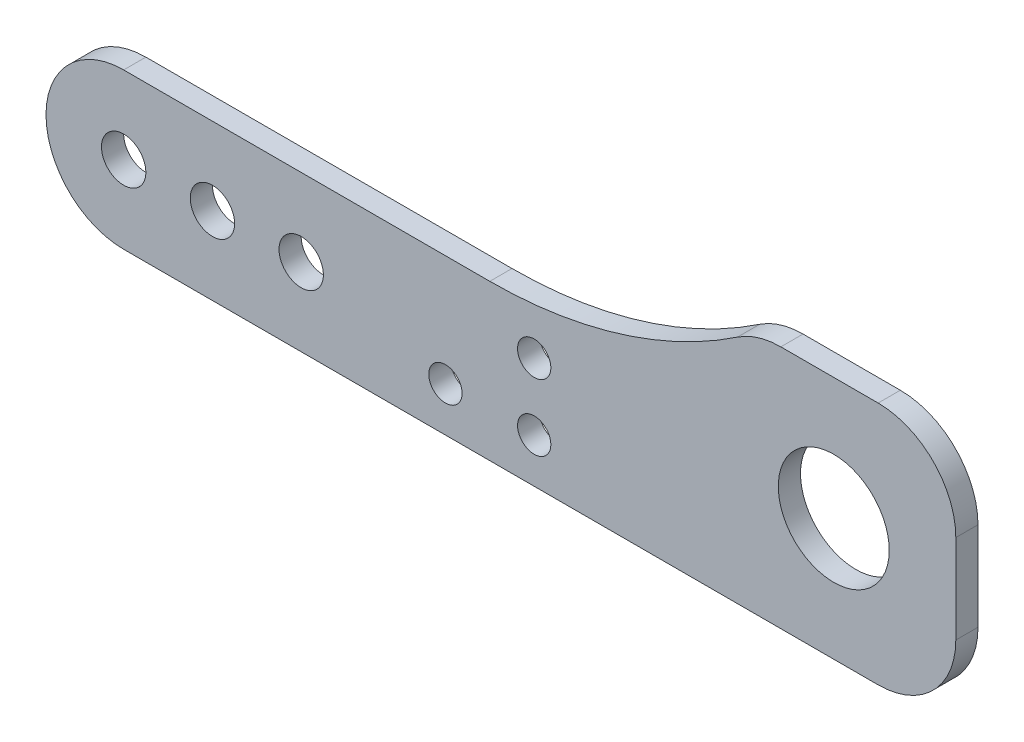
ISO-10303-21;
HEADER;
FILE_DESCRIPTION(('STEP AP214'),'2;1');
FILE_NAME('part.step','',(''),(''),'','','');
FILE_SCHEMA(('AUTOMOTIVE_DESIGN { 1 0 10303 214 1 1 1 1 }'));
ENDSEC;
DATA;
#1=APPLICATION_CONTEXT('core data for automotive mechanical design processes');
#2=APPLICATION_PROTOCOL_DEFINITION('international standard','automotive_design',2000,#1);
#3=PRODUCT_CONTEXT('',#1,'mechanical');
#4=PRODUCT('Part','Part','',(#3));
#5=PRODUCT_RELATED_PRODUCT_CATEGORY('part','',(#4));
#6=PRODUCT_DEFINITION_FORMATION('','',#4);
#7=PRODUCT_DEFINITION_CONTEXT('part definition',#1,'design');
#8=PRODUCT_DEFINITION('design','',#6,#7);
#9=PRODUCT_DEFINITION_SHAPE('','',#8);
#10=(LENGTH_UNIT() NAMED_UNIT(*) SI_UNIT(.MILLI.,.METRE.));
#11=(NAMED_UNIT(*) PLANE_ANGLE_UNIT() SI_UNIT($,.RADIAN.));
#12=(NAMED_UNIT(*) SI_UNIT($,.STERADIAN.) SOLID_ANGLE_UNIT());
#13=UNCERTAINTY_MEASURE_WITH_UNIT(LENGTH_MEASURE(1.E-05),#10,'distance_accuracy_value','');
#14=(GEOMETRIC_REPRESENTATION_CONTEXT(3) GLOBAL_UNCERTAINTY_ASSIGNED_CONTEXT((#13)) GLOBAL_UNIT_ASSIGNED_CONTEXT((#10,
#11,#12)) REPRESENTATION_CONTEXT('',''));
#15=CARTESIAN_POINT('',(0.,0.,0.));
#16=DIRECTION('',(0.,0.,1.));
#17=DIRECTION('',(1.,0.,0.));
#18=AXIS2_PLACEMENT_3D('',#15,#16,#17);
#19=CARTESIAN_POINT('',(68.,0.,2.));
#20=DIRECTION('',(0.,0.,-1.));
#21=DIRECTION('',(-1.,0.,0.));
#22=AXIS2_PLACEMENT_3D('',#19,#20,#21);
#23=CYLINDRICAL_SURFACE('',#22,7.);
#24=CARTESIAN_POINT('',(68.,0.,0.));
#25=DIRECTION('',(0.,0.,1.));
#26=DIRECTION('',(1.,0.,0.));
#27=AXIS2_PLACEMENT_3D('',#24,#25,#26);
#28=CIRCLE('',#27,7.);
#29=CARTESIAN_POINT('',(68.,-6.99999999999999,0.));
#30=VERTEX_POINT('',#29);
#31=CARTESIAN_POINT('',(75.,0.,0.));
#32=VERTEX_POINT('',#31);
#33=EDGE_CURVE('E146',#30,#32,#28,.T.);
#34=ORIENTED_EDGE('',*,*,#33,.T.);
#35=DIRECTION('',(0.,0.,-1.));
#36=VECTOR('',#35,1.);
#37=CARTESIAN_POINT('',(75.,0.,2.));
#38=LINE('',#37,#36);
#39=CARTESIAN_POINT('',(75.,0.,2.));
#40=VERTEX_POINT('',#39);
#41=EDGE_CURVE('E11',#40,#32,#38,.T.);
#42=ORIENTED_EDGE('',*,*,#41,.F.);
#43=CARTESIAN_POINT('',(68.,0.,2.));
#44=DIRECTION('',(0.,0.,1.));
#45=DIRECTION('',(1.,0.,0.));
#46=AXIS2_PLACEMENT_3D('',#43,#44,#45);
#47=CIRCLE('',#46,7.);
#48=CARTESIAN_POINT('',(68.,-6.99999999999999,2.));
#49=VERTEX_POINT('',#48);
#50=EDGE_CURVE('E172',#49,#40,#47,.T.);
#51=ORIENTED_EDGE('',*,*,#50,.F.);
#52=DIRECTION('',(0.,0.,-1.));
#53=VECTOR('',#52,1.);
#54=CARTESIAN_POINT('',(68.,-6.99999999999999,2.));
#55=LINE('',#54,#53);
#56=EDGE_CURVE('E142',#49,#30,#55,.T.);
#57=ORIENTED_EDGE('',*,*,#56,.T.);
#58=EDGE_LOOP('',(#34,#42,#51,#57));
#59=FACE_BOUND('',#58,.T.);
#60=ADVANCED_FACE('F39',(#59),#23,.T.);
#61=CARTESIAN_POINT('',(75.,0.,2.));
#62=DIRECTION('',(-1.,0.,0.));
#63=DIRECTION('',(0.,-1.,0.));
#64=AXIS2_PLACEMENT_3D('',#61,#62,#63);
#65=PLANE('',#64);
#66=DIRECTION('',(0.,1.,0.));
#67=VECTOR('',#66,1.);
#68=CARTESIAN_POINT('',(75.,0.,0.));
#69=LINE('',#68,#67);
#70=CARTESIAN_POINT('',(75.,8.00000000000001,0.));
#71=VERTEX_POINT('',#70);
#72=EDGE_CURVE('E150',#32,#71,#69,.T.);
#73=ORIENTED_EDGE('',*,*,#72,.T.);
#74=DIRECTION('',(0.,0.,-1.));
#75=VECTOR('',#74,1.);
#76=CARTESIAN_POINT('',(75.,8.00000000000001,2.));
#77=LINE('',#76,#75);
#78=CARTESIAN_POINT('',(75.,8.00000000000001,2.));
#79=VERTEX_POINT('',#78);
#80=EDGE_CURVE('E48',#79,#71,#77,.T.);
#81=ORIENTED_EDGE('',*,*,#80,.F.);
#82=DIRECTION('',(0.,1.,0.));
#83=VECTOR('',#82,1.);
#84=CARTESIAN_POINT('',(75.,0.,2.));
#85=LINE('',#84,#83);
#86=EDGE_CURVE('E102',#40,#79,#85,.T.);
#87=ORIENTED_EDGE('',*,*,#86,.F.);
#88=ORIENTED_EDGE('',*,*,#41,.T.);
#89=EDGE_LOOP('',(#73,#81,#87,#88));
#90=FACE_BOUND('',#89,.T.);
#91=ADVANCED_FACE('F315',(#90),#65,.F.);
#92=CARTESIAN_POINT('',(68.,8.00000000000001,2.));
#93=DIRECTION('',(0.,0.,-1.));
#94=DIRECTION('',(-1.,0.,0.));
#95=AXIS2_PLACEMENT_3D('',#92,#93,#94);
#96=CYLINDRICAL_SURFACE('',#95,7.);
#97=CARTESIAN_POINT('',(68.,8.00000000000001,0.));
#98=DIRECTION('',(0.,0.,1.));
#99=DIRECTION('',(-1.,0.,0.));
#100=AXIS2_PLACEMENT_3D('',#97,#98,#99);
#101=CIRCLE('',#100,7.);
#102=CARTESIAN_POINT('',(68.,15.,0.));
#103=VERTEX_POINT('',#102);
#104=EDGE_CURVE('E154',#71,#103,#101,.T.);
#105=ORIENTED_EDGE('',*,*,#104,.T.);
#106=DIRECTION('',(0.,0.,-1.));
#107=VECTOR('',#106,1.);
#108=CARTESIAN_POINT('',(68.,15.,2.));
#109=LINE('',#108,#107);
#110=CARTESIAN_POINT('',(68.,15.,2.));
#111=VERTEX_POINT('',#110);
#112=EDGE_CURVE('E187',#111,#103,#109,.T.);
#113=ORIENTED_EDGE('',*,*,#112,.F.);
#114=CARTESIAN_POINT('',(68.,8.00000000000001,2.));
#115=DIRECTION('',(0.,0.,1.));
#116=DIRECTION('',(-1.,0.,0.));
#117=AXIS2_PLACEMENT_3D('',#114,#115,#116);
#118=CIRCLE('',#117,7.);
#119=EDGE_CURVE('E197',#79,#111,#118,.T.);
#120=ORIENTED_EDGE('',*,*,#119,.F.);
#121=ORIENTED_EDGE('',*,*,#80,.T.);
#122=EDGE_LOOP('',(#105,#113,#120,#121));
#123=FACE_BOUND('',#122,.T.);
#124=ADVANCED_FACE('F195',(#123),#96,.T.);
#125=CARTESIAN_POINT('',(59.229754097208,15.,2.));
#126=DIRECTION('',(0.,-1.,0.));
#127=DIRECTION('',(0.,0.,-1.));
#128=AXIS2_PLACEMENT_3D('',#125,#126,#127);
#129=PLANE('',#128);
#130=DIRECTION('',(-1.,0.,0.));
#131=VECTOR('',#130,1.);
#132=CARTESIAN_POINT('',(59.229754097208,15.,0.));
#133=LINE('',#132,#131);
#134=CARTESIAN_POINT('',(59.229754097208,15.,0.));
#135=VERTEX_POINT('',#134);
#136=EDGE_CURVE('E157',#103,#135,#133,.T.);
#137=ORIENTED_EDGE('',*,*,#136,.T.);
#138=DIRECTION('',(0.,0.,-1.));
#139=VECTOR('',#138,1.);
#140=CARTESIAN_POINT('',(59.229754097208,15.,2.));
#141=LINE('',#140,#139);
#142=CARTESIAN_POINT('',(59.229754097208,15.,2.));
#143=VERTEX_POINT('',#142);
#144=EDGE_CURVE('E183',#143,#135,#141,.T.);
#145=ORIENTED_EDGE('',*,*,#144,.F.);
#146=DIRECTION('',(-1.,0.,0.));
#147=VECTOR('',#146,1.);
#148=CARTESIAN_POINT('',(59.229754097208,15.,2.));
#149=LINE('',#148,#147);
#150=EDGE_CURVE('E214',#111,#143,#149,.T.);
#151=ORIENTED_EDGE('',*,*,#150,.F.);
#152=ORIENTED_EDGE('',*,*,#112,.T.);
#153=EDGE_LOOP('',(#137,#145,#151,#152));
#154=FACE_BOUND('',#153,.T.);
#155=ADVANCED_FACE('F206',(#154),#129,.F.);
#156=CARTESIAN_POINT('',(59.229754097208,8.00000000000001,2.));
#157=DIRECTION('',(0.,0.,-1.));
#158=DIRECTION('',(-1.,0.,0.));
#159=AXIS2_PLACEMENT_3D('',#156,#157,#158);
#160=CYLINDRICAL_SURFACE('',#159,7.);
#161=CARTESIAN_POINT('',(59.229754097208,8.00000000000001,0.));
#162=DIRECTION('',(0.,0.,1.));
#163=DIRECTION('',(1.,0.,0.));
#164=AXIS2_PLACEMENT_3D('',#161,#162,#163);
#165=CIRCLE('',#164,7.);
#166=CARTESIAN_POINT('',(55.3231949763472,13.8085106382979,0.));
#167=VERTEX_POINT('',#166);
#168=EDGE_CURVE('E160',#135,#167,#165,.T.);
#169=ORIENTED_EDGE('',*,*,#168,.T.);
#170=DIRECTION('',(0.,0.,-1.));
#171=VECTOR('',#170,1.);
#172=CARTESIAN_POINT('',(55.3231949763472,13.8085106382979,2.));
#173=LINE('',#172,#171);
#174=CARTESIAN_POINT('',(55.3231949763472,13.8085106382979,2.));
#175=VERTEX_POINT('',#174);
#176=EDGE_CURVE('E179',#175,#167,#173,.T.);
#177=ORIENTED_EDGE('',*,*,#176,.F.);
#178=CARTESIAN_POINT('',(59.229754097208,8.00000000000001,2.));
#179=DIRECTION('',(0.,0.,1.));
#180=DIRECTION('',(1.,0.,0.));
#181=AXIS2_PLACEMENT_3D('',#178,#179,#180);
#182=CIRCLE('',#181,7.);
#183=EDGE_CURVE('E212',#143,#175,#182,.T.);
#184=ORIENTED_EDGE('',*,*,#183,.F.);
#185=ORIENTED_EDGE('',*,*,#144,.T.);
#186=EDGE_LOOP('',(#169,#177,#184,#185));
#187=FACE_BOUND('',#186,.T.);
#188=ADVANCED_FACE('F210',(#187),#160,.T.);
#189=CARTESIAN_POINT('',(33.,47.,2.));
#190=DIRECTION('',(0.,0.,-1.));
#191=DIRECTION('',(-1.,0.,0.));
#192=AXIS2_PLACEMENT_3D('',#189,#190,#191);
#193=CYLINDRICAL_SURFACE('',#192,40.);
#194=CARTESIAN_POINT('',(33.,47.,0.));
#195=DIRECTION('',(0.,0.,-1.));
#196=DIRECTION('',(1.,0.,0.));
#197=AXIS2_PLACEMENT_3D('',#194,#195,#196);
#198=CIRCLE('',#197,40.);
#199=CARTESIAN_POINT('',(33.,7.,0.));
#200=VERTEX_POINT('',#199);
#201=EDGE_CURVE('E163',#167,#200,#198,.T.);
#202=ORIENTED_EDGE('',*,*,#201,.T.);
#203=DIRECTION('',(0.,0.,-1.));
#204=VECTOR('',#203,1.);
#205=CARTESIAN_POINT('',(33.,7.,2.));
#206=LINE('',#205,#204);
#207=CARTESIAN_POINT('',(33.,7.,2.));
#208=VERTEX_POINT('',#207);
#209=EDGE_CURVE('E135',#208,#200,#206,.T.);
#210=ORIENTED_EDGE('',*,*,#209,.F.);
#211=CARTESIAN_POINT('',(33.,47.,2.));
#212=DIRECTION('',(0.,0.,-1.));
#213=DIRECTION('',(1.,0.,0.));
#214=AXIS2_PLACEMENT_3D('',#211,#212,#213);
#215=CIRCLE('',#214,40.);
#216=EDGE_CURVE('E124',#175,#208,#215,.T.);
#217=ORIENTED_EDGE('',*,*,#216,.F.);
#218=ORIENTED_EDGE('',*,*,#176,.T.);
#219=EDGE_LOOP('',(#202,#210,#217,#218));
#220=FACE_BOUND('',#219,.T.);
#221=ADVANCED_FACE('F323',(#220),#193,.F.);
#222=CARTESIAN_POINT('',(0.,7.,2.));
#223=DIRECTION('',(0.,-1.,0.));
#224=DIRECTION('',(1.,0.,0.));
#225=AXIS2_PLACEMENT_3D('',#222,#223,#224);
#226=PLANE('',#225);
#227=DIRECTION('',(-1.,0.,0.));
#228=VECTOR('',#227,1.);
#229=CARTESIAN_POINT('',(0.,7.,0.));
#230=LINE('',#229,#228);
#231=CARTESIAN_POINT('',(0.,7.,0.));
#232=VERTEX_POINT('',#231);
#233=EDGE_CURVE('E133',#200,#232,#230,.T.);
#234=ORIENTED_EDGE('',*,*,#233,.T.);
#235=DIRECTION('',(0.,0.,-1.));
#236=VECTOR('',#235,1.);
#237=CARTESIAN_POINT('',(0.,7.,2.));
#238=LINE('',#237,#236);
#239=CARTESIAN_POINT('',(0.,7.,2.));
#240=VERTEX_POINT('',#239);
#241=EDGE_CURVE('E130',#240,#232,#238,.T.);
#242=ORIENTED_EDGE('',*,*,#241,.F.);
#243=DIRECTION('',(-1.,0.,0.));
#244=VECTOR('',#243,1.);
#245=CARTESIAN_POINT('',(0.,7.,2.));
#246=LINE('',#245,#244);
#247=EDGE_CURVE('E118',#208,#240,#246,.T.);
#248=ORIENTED_EDGE('',*,*,#247,.F.);
#249=ORIENTED_EDGE('',*,*,#209,.T.);
#250=EDGE_LOOP('',(#234,#242,#248,#249));
#251=FACE_BOUND('',#250,.T.);
#252=ADVANCED_FACE('F131',(#251),#226,.F.);
#253=CARTESIAN_POINT('',(0.,0.,2.));
#254=DIRECTION('',(0.,0.,-1.));
#255=DIRECTION('',(-1.,0.,0.));
#256=AXIS2_PLACEMENT_3D('',#253,#254,#255);
#257=CYLINDRICAL_SURFACE('',#256,7.);
#258=CARTESIAN_POINT('',(0.,0.,0.));
#259=DIRECTION('',(0.,0.,1.));
#260=DIRECTION('',(-1.,0.,0.));
#261=AXIS2_PLACEMENT_3D('',#258,#259,#260);
#262=CIRCLE('',#261,7.);
#263=CARTESIAN_POINT('',(0.,-7.,0.));
#264=VERTEX_POINT('',#263);
#265=EDGE_CURVE('E88',#232,#264,#262,.T.);
#266=ORIENTED_EDGE('',*,*,#265,.T.);
#267=DIRECTION('',(0.,0.,-1.));
#268=VECTOR('',#267,1.);
#269=CARTESIAN_POINT('',(0.,-7.,2.));
#270=LINE('',#269,#268);
#271=CARTESIAN_POINT('',(0.,-7.,2.));
#272=VERTEX_POINT('',#271);
#273=EDGE_CURVE('E136',#272,#264,#270,.T.);
#274=ORIENTED_EDGE('',*,*,#273,.F.);
#275=CARTESIAN_POINT('',(0.,0.,2.));
#276=DIRECTION('',(0.,0.,1.));
#277=DIRECTION('',(-1.,0.,0.));
#278=AXIS2_PLACEMENT_3D('',#275,#276,#277);
#279=CIRCLE('',#278,7.);
#280=EDGE_CURVE('E122',#240,#272,#279,.T.);
#281=ORIENTED_EDGE('',*,*,#280,.F.);
#282=ORIENTED_EDGE('',*,*,#241,.T.);
#283=EDGE_LOOP('',(#266,#274,#281,#282));
#284=FACE_BOUND('',#283,.T.);
#285=ADVANCED_FACE('F138',(#284),#257,.T.);
#286=CARTESIAN_POINT('',(68.,-6.99999999999999,2.));
#287=DIRECTION('',(0.,1.,0.));
#288=DIRECTION('',(-1.,0.,0.));
#289=AXIS2_PLACEMENT_3D('',#286,#287,#288);
#290=PLANE('',#289);
#291=DIRECTION('',(1.,0.,0.));
#292=VECTOR('',#291,1.);
#293=CARTESIAN_POINT('',(68.,-6.99999999999999,0.));
#294=LINE('',#293,#292);
#295=EDGE_CURVE('E94',#264,#30,#294,.T.);
#296=ORIENTED_EDGE('',*,*,#295,.T.);
#297=ORIENTED_EDGE('',*,*,#56,.F.);
#298=DIRECTION('',(1.,0.,0.));
#299=VECTOR('',#298,1.);
#300=CARTESIAN_POINT('',(68.,-6.99999999999999,2.));
#301=LINE('',#300,#299);
#302=EDGE_CURVE('E56',#272,#49,#301,.T.);
#303=ORIENTED_EDGE('',*,*,#302,.F.);
#304=ORIENTED_EDGE('',*,*,#273,.T.);
#305=EDGE_LOOP('',(#296,#297,#303,#304));
#306=FACE_BOUND('',#305,.T.);
#307=ADVANCED_FACE('F286',(#306),#290,.F.);
#308=CARTESIAN_POINT('',(68.,0.,2.));
#309=DIRECTION('',(0.,0.,1.));
#310=DIRECTION('',(1.,0.,0.));
#311=AXIS2_PLACEMENT_3D('',#308,#309,#310);
#312=PLANE('',#311);
#313=CARTESIAN_POINT('',(29.,-3.00000000000019,2.));
#314=DIRECTION('',(0.,0.,1.));
#315=DIRECTION('',(1.,0.,0.));
#316=AXIS2_PLACEMENT_3D('',#313,#314,#315);
#317=CIRCLE('',#316,1.5);
#318=CARTESIAN_POINT('',(30.5,-3.00000000000019,2.));
#319=VERTEX_POINT('',#318);
#320=EDGE_CURVE('E277',#319,#319,#317,.T.);
#321=ORIENTED_EDGE('',*,*,#320,.F.);
#322=EDGE_LOOP('',(#321));
#323=FACE_BOUND('',#322,.T.);
#324=CARTESIAN_POINT('',(37.,-3.00000000000019,2.));
#325=DIRECTION('',(0.,0.,1.));
#326=DIRECTION('',(1.,0.,0.));
#327=AXIS2_PLACEMENT_3D('',#324,#325,#326);
#328=CIRCLE('',#327,1.5);
#329=CARTESIAN_POINT('',(38.5,-3.00000000000019,2.));
#330=VERTEX_POINT('',#329);
#331=EDGE_CURVE('E269',#330,#330,#328,.T.);
#332=ORIENTED_EDGE('',*,*,#331,.F.);
#333=EDGE_LOOP('',(#332));
#334=FACE_BOUND('',#333,.T.);
#335=CARTESIAN_POINT('',(37.,2.99999999999981,2.));
#336=DIRECTION('',(0.,0.,1.));
#337=DIRECTION('',(1.,0.,0.));
#338=AXIS2_PLACEMENT_3D('',#335,#336,#337);
#339=CIRCLE('',#338,1.5);
#340=CARTESIAN_POINT('',(38.5,2.99999999999981,2.));
#341=VERTEX_POINT('',#340);
#342=EDGE_CURVE('E261',#341,#341,#339,.T.);
#343=ORIENTED_EDGE('',*,*,#342,.F.);
#344=EDGE_LOOP('',(#343));
#345=FACE_BOUND('',#344,.T.);
#346=CARTESIAN_POINT('',(64.,4.00000000000001,2.));
#347=DIRECTION('',(0.,0.,1.));
#348=DIRECTION('',(1.,0.,0.));
#349=AXIS2_PLACEMENT_3D('',#346,#347,#348);
#350=CIRCLE('',#349,5.);
#351=CARTESIAN_POINT('',(69.,4.00000000000001,2.));
#352=VERTEX_POINT('',#351);
#353=EDGE_CURVE('E253',#352,#352,#350,.T.);
#354=ORIENTED_EDGE('',*,*,#353,.F.);
#355=EDGE_LOOP('',(#354));
#356=FACE_BOUND('',#355,.T.);
#357=CARTESIAN_POINT('',(0.,0.,2.));
#358=DIRECTION('',(0.,0.,1.));
#359=DIRECTION('',(1.,0.,0.));
#360=AXIS2_PLACEMENT_3D('',#357,#358,#359);
#361=CIRCLE('',#360,2.);
#362=CARTESIAN_POINT('',(2.,0.,2.));
#363=VERTEX_POINT('',#362);
#364=EDGE_CURVE('E240',#363,#363,#361,.T.);
#365=ORIENTED_EDGE('',*,*,#364,.F.);
#366=EDGE_LOOP('',(#365));
#367=FACE_BOUND('',#366,.T.);
#368=CARTESIAN_POINT('',(8.,0.,2.));
#369=DIRECTION('',(0.,0.,1.));
#370=DIRECTION('',(1.,0.,0.));
#371=AXIS2_PLACEMENT_3D('',#368,#369,#370);
#372=CIRCLE('',#371,2.);
#373=CARTESIAN_POINT('',(10.,0.,2.));
#374=VERTEX_POINT('',#373);
#375=EDGE_CURVE('E230',#374,#374,#372,.T.);
#376=ORIENTED_EDGE('',*,*,#375,.F.);
#377=EDGE_LOOP('',(#376));
#378=FACE_BOUND('',#377,.T.);
#379=CARTESIAN_POINT('',(16.,0.,2.));
#380=DIRECTION('',(0.,0.,1.));
#381=DIRECTION('',(1.,0.,0.));
#382=AXIS2_PLACEMENT_3D('',#379,#380,#381);
#383=CIRCLE('',#382,2.);
#384=CARTESIAN_POINT('',(18.,0.,2.));
#385=VERTEX_POINT('',#384);
#386=EDGE_CURVE('E231',#385,#385,#383,.T.);
#387=ORIENTED_EDGE('',*,*,#386,.F.);
#388=EDGE_LOOP('',(#387));
#389=FACE_BOUND('',#388,.T.);
#390=ORIENTED_EDGE('',*,*,#50,.T.);
#391=ORIENTED_EDGE('',*,*,#86,.T.);
#392=ORIENTED_EDGE('',*,*,#119,.T.);
#393=ORIENTED_EDGE('',*,*,#150,.T.);
#394=ORIENTED_EDGE('',*,*,#183,.T.);
#395=ORIENTED_EDGE('',*,*,#216,.T.);
#396=ORIENTED_EDGE('',*,*,#247,.T.);
#397=ORIENTED_EDGE('',*,*,#280,.T.);
#398=ORIENTED_EDGE('',*,*,#302,.T.);
#399=EDGE_LOOP('',(#390,#391,#392,#393,#394,#395,#396,#397,#398));
#400=FACE_BOUND('',#399,.T.);
#401=ADVANCED_FACE('F120',(#323,#334,#345,#356,#367,#378,#389,#400),#312,.T.);
#402=CARTESIAN_POINT('',(68.,0.,0.));
#403=DIRECTION('',(0.,0.,1.));
#404=DIRECTION('',(1.,0.,0.));
#405=AXIS2_PLACEMENT_3D('',#402,#403,#404);
#406=PLANE('',#405);
#407=CARTESIAN_POINT('',(29.,-3.00000000000019,0.));
#408=DIRECTION('',(0.,0.,1.));
#409=DIRECTION('',(1.,0.,0.));
#410=AXIS2_PLACEMENT_3D('',#407,#408,#409);
#411=CIRCLE('',#410,1.5);
#412=CARTESIAN_POINT('',(30.5,-3.00000000000019,0.));
#413=VERTEX_POINT('',#412);
#414=EDGE_CURVE('E273',#413,#413,#411,.T.);
#415=ORIENTED_EDGE('',*,*,#414,.T.);
#416=EDGE_LOOP('',(#415));
#417=FACE_BOUND('',#416,.T.);
#418=CARTESIAN_POINT('',(37.,-3.00000000000019,0.));
#419=DIRECTION('',(0.,0.,1.));
#420=DIRECTION('',(1.,0.,0.));
#421=AXIS2_PLACEMENT_3D('',#418,#419,#420);
#422=CIRCLE('',#421,1.5);
#423=CARTESIAN_POINT('',(38.5,-3.00000000000019,0.));
#424=VERTEX_POINT('',#423);
#425=EDGE_CURVE('E265',#424,#424,#422,.T.);
#426=ORIENTED_EDGE('',*,*,#425,.T.);
#427=EDGE_LOOP('',(#426));
#428=FACE_BOUND('',#427,.T.);
#429=CARTESIAN_POINT('',(37.,2.99999999999981,0.));
#430=DIRECTION('',(0.,0.,1.));
#431=DIRECTION('',(1.,0.,0.));
#432=AXIS2_PLACEMENT_3D('',#429,#430,#431);
#433=CIRCLE('',#432,1.5);
#434=CARTESIAN_POINT('',(38.5,2.99999999999981,0.));
#435=VERTEX_POINT('',#434);
#436=EDGE_CURVE('E257',#435,#435,#433,.T.);
#437=ORIENTED_EDGE('',*,*,#436,.T.);
#438=EDGE_LOOP('',(#437));
#439=FACE_BOUND('',#438,.T.);
#440=CARTESIAN_POINT('',(64.,4.00000000000001,0.));
#441=DIRECTION('',(0.,0.,1.));
#442=DIRECTION('',(1.,0.,0.));
#443=AXIS2_PLACEMENT_3D('',#440,#441,#442);
#444=CIRCLE('',#443,5.);
#445=CARTESIAN_POINT('',(69.,4.00000000000001,0.));
#446=VERTEX_POINT('',#445);
#447=EDGE_CURVE('E235',#446,#446,#444,.F.);
#448=ORIENTED_EDGE('',*,*,#447,.F.);
#449=EDGE_LOOP('',(#448));
#450=FACE_BOUND('',#449,.T.);
#451=CARTESIAN_POINT('',(0.,0.,0.));
#452=DIRECTION('',(0.,0.,1.));
#453=DIRECTION('',(1.,0.,0.));
#454=AXIS2_PLACEMENT_3D('',#451,#452,#453);
#455=CIRCLE('',#454,2.);
#456=CARTESIAN_POINT('',(2.,0.,0.));
#457=VERTEX_POINT('',#456);
#458=EDGE_CURVE('E151',#457,#457,#455,.F.);
#459=ORIENTED_EDGE('',*,*,#458,.F.);
#460=EDGE_LOOP('',(#459));
#461=FACE_BOUND('',#460,.T.);
#462=CARTESIAN_POINT('',(8.,0.,0.));
#463=DIRECTION('',(0.,0.,1.));
#464=DIRECTION('',(1.,0.,0.));
#465=AXIS2_PLACEMENT_3D('',#462,#463,#464);
#466=CIRCLE('',#465,2.);
#467=CARTESIAN_POINT('',(10.,0.,0.));
#468=VERTEX_POINT('',#467);
#469=EDGE_CURVE('E236',#468,#468,#466,.F.);
#470=ORIENTED_EDGE('',*,*,#469,.F.);
#471=EDGE_LOOP('',(#470));
#472=FACE_BOUND('',#471,.T.);
#473=CARTESIAN_POINT('',(16.,0.,0.));
#474=DIRECTION('',(0.,0.,1.));
#475=DIRECTION('',(1.,0.,0.));
#476=AXIS2_PLACEMENT_3D('',#473,#474,#475);
#477=CIRCLE('',#476,2.);
#478=CARTESIAN_POINT('',(18.,0.,0.));
#479=VERTEX_POINT('',#478);
#480=EDGE_CURVE('E226',#479,#479,#477,.F.);
#481=ORIENTED_EDGE('',*,*,#480,.F.);
#482=EDGE_LOOP('',(#481));
#483=FACE_BOUND('',#482,.T.);
#484=ORIENTED_EDGE('',*,*,#33,.F.);
#485=ORIENTED_EDGE('',*,*,#295,.F.);
#486=ORIENTED_EDGE('',*,*,#265,.F.);
#487=ORIENTED_EDGE('',*,*,#233,.F.);
#488=ORIENTED_EDGE('',*,*,#201,.F.);
#489=ORIENTED_EDGE('',*,*,#168,.F.);
#490=ORIENTED_EDGE('',*,*,#136,.F.);
#491=ORIENTED_EDGE('',*,*,#104,.F.);
#492=ORIENTED_EDGE('',*,*,#72,.F.);
#493=EDGE_LOOP('',(#484,#485,#486,#487,#488,#489,#490,#491,#492));
#494=FACE_BOUND('',#493,.T.);
#495=ADVANCED_FACE('F201',(#417,#428,#439,#450,#461,#472,#483,#494),#406,.F.);
#496=CARTESIAN_POINT('',(16.,0.,-5.65685424949239));
#497=DIRECTION('',(0.,0.,1.));
#498=DIRECTION('',(1.,0.,0.));
#499=AXIS2_PLACEMENT_3D('',#496,#497,#498);
#500=CYLINDRICAL_SURFACE('',#499,2.);
#501=ORIENTED_EDGE('',*,*,#480,.T.);
#502=EDGE_LOOP('',(#501));
#503=FACE_BOUND('',#502,.T.);
#504=ORIENTED_EDGE('',*,*,#386,.T.);
#505=EDGE_LOOP('',(#504));
#506=FACE_BOUND('',#505,.T.);
#507=ADVANCED_FACE('F300',(#503,#506),#500,.F.);
#508=CARTESIAN_POINT('',(8.,0.,-5.65685424949239));
#509=DIRECTION('',(0.,0.,1.));
#510=DIRECTION('',(1.,0.,0.));
#511=AXIS2_PLACEMENT_3D('',#508,#509,#510);
#512=CYLINDRICAL_SURFACE('',#511,2.);
#513=ORIENTED_EDGE('',*,*,#469,.T.);
#514=EDGE_LOOP('',(#513));
#515=FACE_BOUND('',#514,.T.);
#516=ORIENTED_EDGE('',*,*,#375,.T.);
#517=EDGE_LOOP('',(#516));
#518=FACE_BOUND('',#517,.T.);
#519=ADVANCED_FACE('F302',(#515,#518),#512,.F.);
#520=CARTESIAN_POINT('',(0.,0.,-5.65685424949239));
#521=DIRECTION('',(0.,0.,1.));
#522=DIRECTION('',(1.,0.,0.));
#523=AXIS2_PLACEMENT_3D('',#520,#521,#522);
#524=CYLINDRICAL_SURFACE('',#523,2.);
#525=ORIENTED_EDGE('',*,*,#458,.T.);
#526=EDGE_LOOP('',(#525));
#527=FACE_BOUND('',#526,.T.);
#528=ORIENTED_EDGE('',*,*,#364,.T.);
#529=EDGE_LOOP('',(#528));
#530=FACE_BOUND('',#529,.T.);
#531=ADVANCED_FACE('F309',(#527,#530),#524,.F.);
#532=CARTESIAN_POINT('',(64.,4.00000000000001,-14.142135623731));
#533=DIRECTION('',(0.,0.,1.));
#534=DIRECTION('',(1.,0.,0.));
#535=AXIS2_PLACEMENT_3D('',#532,#533,#534);
#536=CYLINDRICAL_SURFACE('',#535,5.);
#537=ORIENTED_EDGE('',*,*,#447,.T.);
#538=EDGE_LOOP('',(#537));
#539=FACE_BOUND('',#538,.T.);
#540=ORIENTED_EDGE('',*,*,#353,.T.);
#541=EDGE_LOOP('',(#540));
#542=FACE_BOUND('',#541,.T.);
#543=ADVANCED_FACE('F395',(#539,#542),#536,.F.);
#544=CARTESIAN_POINT('',(37.,2.99999999999981,2.));
#545=DIRECTION('',(0.,0.,1.));
#546=DIRECTION('',(1.,0.,0.));
#547=AXIS2_PLACEMENT_3D('',#544,#545,#546);
#548=CYLINDRICAL_SURFACE('',#547,1.5);
#549=ORIENTED_EDGE('',*,*,#436,.F.);
#550=EDGE_LOOP('',(#549));
#551=FACE_BOUND('',#550,.T.);
#552=ORIENTED_EDGE('',*,*,#342,.T.);
#553=EDGE_LOOP('',(#552));
#554=FACE_BOUND('',#553,.T.);
#555=ADVANCED_FACE('F405',(#551,#554),#548,.F.);
#556=CARTESIAN_POINT('',(37.,-3.00000000000019,2.));
#557=DIRECTION('',(0.,0.,1.));
#558=DIRECTION('',(1.,0.,0.));
#559=AXIS2_PLACEMENT_3D('',#556,#557,#558);
#560=CYLINDRICAL_SURFACE('',#559,1.5);
#561=ORIENTED_EDGE('',*,*,#425,.F.);
#562=EDGE_LOOP('',(#561));
#563=FACE_BOUND('',#562,.T.);
#564=ORIENTED_EDGE('',*,*,#331,.T.);
#565=EDGE_LOOP('',(#564));
#566=FACE_BOUND('',#565,.T.);
#567=ADVANCED_FACE('F425',(#563,#566),#560,.F.);
#568=CARTESIAN_POINT('',(29.,-3.00000000000019,2.));
#569=DIRECTION('',(0.,0.,1.));
#570=DIRECTION('',(1.,0.,0.));
#571=AXIS2_PLACEMENT_3D('',#568,#569,#570);
#572=CYLINDRICAL_SURFACE('',#571,1.5);
#573=ORIENTED_EDGE('',*,*,#414,.F.);
#574=EDGE_LOOP('',(#573));
#575=FACE_BOUND('',#574,.T.);
#576=ORIENTED_EDGE('',*,*,#320,.T.);
#577=EDGE_LOOP('',(#576));
#578=FACE_BOUND('',#577,.T.);
#579=ADVANCED_FACE('F282',(#575,#578),#572,.F.);
#580=CLOSED_SHELL('',(#60,#91,#124,#155,#188,#221,#252,#285,#307,#401,#495,#507,#519,#531,#543,
#555,#567,#579));
#581=MANIFOLD_SOLID_BREP('B2',#580);
#582=ADVANCED_BREP_SHAPE_REPRESENTATION('',(#18,#581),#14);
#583=SHAPE_DEFINITION_REPRESENTATION(#9,#582);
ENDSEC;
END-ISO-10303-21;
